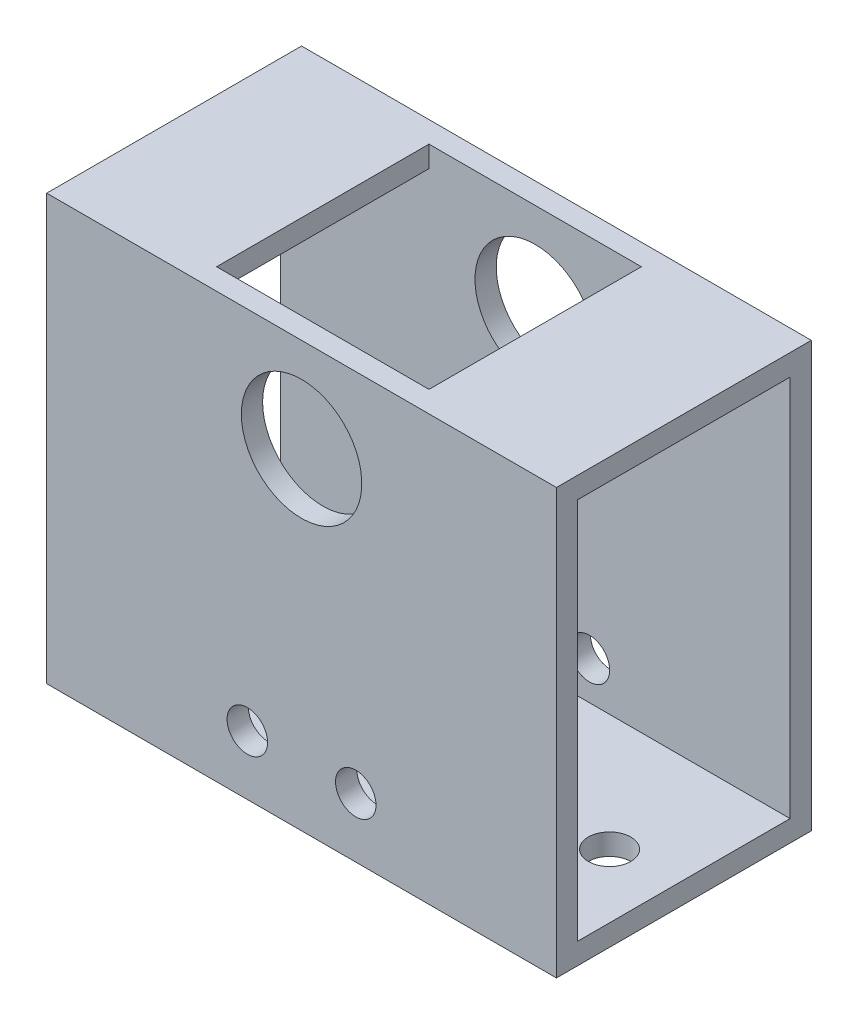
ISO-10303-21;
HEADER;
FILE_DESCRIPTION(('STEP AP214'),'2;1');
FILE_NAME('part.step','',(''),(''),'','','');
FILE_SCHEMA(('AUTOMOTIVE_DESIGN { 1 0 10303 214 1 1 1 1 }'));
ENDSEC;
DATA;
#1=APPLICATION_CONTEXT('core data for automotive mechanical design processes');
#2=APPLICATION_PROTOCOL_DEFINITION('international standard','automotive_design',2000,#1);
#3=PRODUCT_CONTEXT('',#1,'mechanical');
#4=PRODUCT('Part','Part','',(#3));
#5=PRODUCT_RELATED_PRODUCT_CATEGORY('part','',(#4));
#6=PRODUCT_DEFINITION_FORMATION('','',#4);
#7=PRODUCT_DEFINITION_CONTEXT('part definition',#1,'design');
#8=PRODUCT_DEFINITION('design','',#6,#7);
#9=PRODUCT_DEFINITION_SHAPE('','',#8);
#10=(LENGTH_UNIT() NAMED_UNIT(*) SI_UNIT(.MILLI.,.METRE.));
#11=(NAMED_UNIT(*) PLANE_ANGLE_UNIT() SI_UNIT($,.RADIAN.));
#12=(NAMED_UNIT(*) SI_UNIT($,.STERADIAN.) SOLID_ANGLE_UNIT());
#13=UNCERTAINTY_MEASURE_WITH_UNIT(LENGTH_MEASURE(1.E-05),#10,'distance_accuracy_value','');
#14=(GEOMETRIC_REPRESENTATION_CONTEXT(3) GLOBAL_UNCERTAINTY_ASSIGNED_CONTEXT((#13)) GLOBAL_UNIT_ASSIGNED_CONTEXT((#10,
#11,#12)) REPRESENTATION_CONTEXT('',''));
#15=CARTESIAN_POINT('',(0.,0.,0.));
#16=DIRECTION('',(0.,0.,1.));
#17=DIRECTION('',(1.,0.,0.));
#18=AXIS2_PLACEMENT_3D('',#15,#16,#17);
#19=CARTESIAN_POINT('',(76.2,31.75,19.05));
#20=DIRECTION('',(0.,-1.,0.));
#21=DIRECTION('',(0.,0.,-1.));
#22=AXIS2_PLACEMENT_3D('',#19,#20,#21);
#23=PLANE('',#22);
#24=DIRECTION('',(0.,0.,1.));
#25=VECTOR('',#24,1.);
#26=CARTESIAN_POINT('',(0.,31.75,19.05));
#27=LINE('',#26,#25);
#28=CARTESIAN_POINT('',(0.,31.75,-19.05));
#29=VERTEX_POINT('',#28);
#30=CARTESIAN_POINT('',(0.,31.75,19.05));
#31=VERTEX_POINT('',#30);
#32=EDGE_CURVE('E270',#29,#31,#27,.T.);
#33=ORIENTED_EDGE('',*,*,#32,.T.);
#34=DIRECTION('',(-1.,0.,0.));
#35=VECTOR('',#34,1.);
#36=CARTESIAN_POINT('',(76.2,31.75,19.05));
#37=LINE('',#36,#35);
#38=CARTESIAN_POINT('',(76.2,31.75,19.05));
#39=VERTEX_POINT('',#38);
#40=EDGE_CURVE('E49',#39,#31,#37,.T.);
#41=ORIENTED_EDGE('',*,*,#40,.F.);
#42=DIRECTION('',(0.,0.,1.));
#43=VECTOR('',#42,1.);
#44=CARTESIAN_POINT('',(76.2,31.75,19.05));
#45=LINE('',#44,#43);
#46=CARTESIAN_POINT('',(76.2,31.75,-19.05));
#47=VERTEX_POINT('',#46);
#48=EDGE_CURVE('E256',#47,#39,#45,.T.);
#49=ORIENTED_EDGE('',*,*,#48,.F.);
#50=DIRECTION('',(-1.,0.,0.));
#51=VECTOR('',#50,1.);
#52=CARTESIAN_POINT('',(76.2,31.75,-19.05));
#53=LINE('',#52,#51);
#54=EDGE_CURVE('E11',#47,#29,#53,.T.);
#55=ORIENTED_EDGE('',*,*,#54,.T.);
#56=EDGE_LOOP('',(#33,#41,#49,#55));
#57=FACE_BOUND('',#56,.T.);
#58=DIRECTION('',(0.,0.,-1.));
#59=VECTOR('',#58,1.);
#60=CARTESIAN_POINT('',(53.975,31.75,19.05));
#61=LINE('',#60,#59);
#62=CARTESIAN_POINT('',(53.975,31.75,15.875));
#63=VERTEX_POINT('',#62);
#64=CARTESIAN_POINT('',(53.975,31.75,-15.875));
#65=VERTEX_POINT('',#64);
#66=EDGE_CURVE('E159',#63,#65,#61,.T.);
#67=ORIENTED_EDGE('',*,*,#66,.F.);
#68=DIRECTION('',(1.,0.,0.));
#69=VECTOR('',#68,1.);
#70=CARTESIAN_POINT('',(76.2,31.75,15.875));
#71=LINE('',#70,#69);
#72=CARTESIAN_POINT('',(22.225,31.75,15.875));
#73=VERTEX_POINT('',#72);
#74=EDGE_CURVE('E143',#73,#63,#71,.T.);
#75=ORIENTED_EDGE('',*,*,#74,.F.);
#76=DIRECTION('',(0.,0.,1.));
#77=VECTOR('',#76,1.);
#78=CARTESIAN_POINT('',(22.225,31.75,19.05));
#79=LINE('',#78,#77);
#80=CARTESIAN_POINT('',(22.225,31.75,-15.875));
#81=VERTEX_POINT('',#80);
#82=EDGE_CURVE('E147',#81,#73,#79,.T.);
#83=ORIENTED_EDGE('',*,*,#82,.F.);
#84=DIRECTION('',(-1.,0.,0.));
#85=VECTOR('',#84,1.);
#86=CARTESIAN_POINT('',(76.2,31.75,-15.875));
#87=LINE('',#86,#85);
#88=EDGE_CURVE('E131',#65,#81,#87,.T.);
#89=ORIENTED_EDGE('',*,*,#88,.F.);
#90=EDGE_LOOP('',(#67,#75,#83,#89));
#91=FACE_BOUND('',#90,.T.);
#92=ADVANCED_FACE('F39',(#57,#91),#23,.F.);
#93=CARTESIAN_POINT('',(76.2,28.575,15.875));
#94=DIRECTION('',(0.,-1.,0.));
#95=DIRECTION('',(0.,0.,-1.));
#96=AXIS2_PLACEMENT_3D('',#93,#94,#95);
#97=PLANE('',#96);
#98=DIRECTION('',(-1.,0.,0.));
#99=VECTOR('',#98,1.);
#100=CARTESIAN_POINT('',(76.2,28.575,15.875));
#101=LINE('',#100,#99);
#102=CARTESIAN_POINT('',(76.2,28.575,15.875));
#103=VERTEX_POINT('',#102);
#104=CARTESIAN_POINT('',(53.975,28.575,15.875));
#105=VERTEX_POINT('',#104);
#106=EDGE_CURVE('E239',#103,#105,#101,.T.);
#107=ORIENTED_EDGE('',*,*,#106,.T.);
#108=DIRECTION('',(0.,0.,-1.));
#109=VECTOR('',#108,1.);
#110=CARTESIAN_POINT('',(53.975,28.575,15.875));
#111=LINE('',#110,#109);
#112=CARTESIAN_POINT('',(53.975,28.575,-15.875));
#113=VERTEX_POINT('',#112);
#114=EDGE_CURVE('E154',#105,#113,#111,.T.);
#115=ORIENTED_EDGE('',*,*,#114,.T.);
#116=DIRECTION('',(-1.,0.,0.));
#117=VECTOR('',#116,1.);
#118=CARTESIAN_POINT('',(76.2,28.575,-15.875));
#119=LINE('',#118,#117);
#120=CARTESIAN_POINT('',(76.2,28.575,-15.875));
#121=VERTEX_POINT('',#120);
#122=EDGE_CURVE('E244',#121,#113,#119,.T.);
#123=ORIENTED_EDGE('',*,*,#122,.F.);
#124=DIRECTION('',(0.,0.,1.));
#125=VECTOR('',#124,1.);
#126=CARTESIAN_POINT('',(76.2,28.575,15.875));
#127=LINE('',#126,#125);
#128=EDGE_CURVE('E213',#121,#103,#127,.T.);
#129=ORIENTED_EDGE('',*,*,#128,.T.);
#130=EDGE_LOOP('',(#107,#115,#123,#129));
#131=FACE_BOUND('',#130,.T.);
#132=ADVANCED_FACE('F326',(#131),#97,.T.);
#133=CARTESIAN_POINT('',(22.225,28.575,-15.875));
#134=VERTEX_POINT('',#133);
#135=CARTESIAN_POINT('',(0.,28.575,-15.875));
#136=VERTEX_POINT('',#135);
#137=EDGE_CURVE('E243',#134,#136,#119,.T.);
#138=ORIENTED_EDGE('',*,*,#137,.F.);
#139=DIRECTION('',(0.,0.,1.));
#140=VECTOR('',#139,1.);
#141=CARTESIAN_POINT('',(22.225,28.575,15.875));
#142=LINE('',#141,#140);
#143=CARTESIAN_POINT('',(22.225,28.575,15.875));
#144=VERTEX_POINT('',#143);
#145=EDGE_CURVE('E150',#134,#144,#142,.T.);
#146=ORIENTED_EDGE('',*,*,#145,.T.);
#147=CARTESIAN_POINT('',(0.,28.575,15.875));
#148=VERTEX_POINT('',#147);
#149=EDGE_CURVE('E238',#144,#148,#101,.T.);
#150=ORIENTED_EDGE('',*,*,#149,.T.);
#151=DIRECTION('',(0.,0.,1.));
#152=VECTOR('',#151,1.);
#153=CARTESIAN_POINT('',(0.,28.575,15.875));
#154=LINE('',#153,#152);
#155=EDGE_CURVE('E228',#136,#148,#154,.T.);
#156=ORIENTED_EDGE('',*,*,#155,.F.);
#157=EDGE_LOOP('',(#138,#146,#150,#156));
#158=FACE_BOUND('',#157,.T.);
#159=ADVANCED_FACE('F344',(#158),#97,.T.);
#160=CARTESIAN_POINT('',(76.2,0.,0.));
#161=DIRECTION('',(-1.,0.,0.));
#162=DIRECTION('',(0.,0.,1.));
#163=AXIS2_PLACEMENT_3D('',#160,#161,#162);
#164=PLANE('',#163);
#165=DIRECTION('',(0.,1.,0.));
#166=VECTOR('',#165,1.);
#167=CARTESIAN_POINT('',(76.2,-31.75,-19.05));
#168=LINE('',#167,#166);
#169=CARTESIAN_POINT('',(76.2,-31.75,-19.05));
#170=VERTEX_POINT('',#169);
#171=EDGE_CURVE('E252',#170,#47,#168,.T.);
#172=ORIENTED_EDGE('',*,*,#171,.T.);
#173=ORIENTED_EDGE('',*,*,#48,.T.);
#174=DIRECTION('',(0.,-1.,0.));
#175=VECTOR('',#174,1.);
#176=CARTESIAN_POINT('',(76.2,-31.75,19.05));
#177=LINE('',#176,#175);
#178=CARTESIAN_POINT('',(76.2,-31.75,19.05));
#179=VERTEX_POINT('',#178);
#180=EDGE_CURVE('E260',#39,#179,#177,.T.);
#181=ORIENTED_EDGE('',*,*,#180,.T.);
#182=DIRECTION('',(0.,0.,-1.));
#183=VECTOR('',#182,1.);
#184=CARTESIAN_POINT('',(76.2,-31.75,19.05));
#185=LINE('',#184,#183);
#186=EDGE_CURVE('E263',#179,#170,#185,.T.);
#187=ORIENTED_EDGE('',*,*,#186,.T.);
#188=EDGE_LOOP('',(#172,#173,#181,#187));
#189=FACE_BOUND('',#188,.T.);
#190=DIRECTION('',(0.,0.,-1.));
#191=VECTOR('',#190,1.);
#192=CARTESIAN_POINT('',(76.2,-28.575,15.875));
#193=LINE('',#192,#191);
#194=CARTESIAN_POINT('',(76.2,-28.575,15.875));
#195=VERTEX_POINT('',#194);
#196=CARTESIAN_POINT('',(76.2,-28.575,-15.875));
#197=VERTEX_POINT('',#196);
#198=EDGE_CURVE('E206',#195,#197,#193,.T.);
#199=ORIENTED_EDGE('',*,*,#198,.F.);
#200=DIRECTION('',(0.,-1.,0.));
#201=VECTOR('',#200,1.);
#202=CARTESIAN_POINT('',(76.2,-28.575,15.875));
#203=LINE('',#202,#201);
#204=EDGE_CURVE('E217',#103,#195,#203,.T.);
#205=ORIENTED_EDGE('',*,*,#204,.F.);
#206=ORIENTED_EDGE('',*,*,#128,.F.);
#207=DIRECTION('',(0.,1.,0.));
#208=VECTOR('',#207,1.);
#209=CARTESIAN_POINT('',(76.2,-28.575,-15.875));
#210=LINE('',#209,#208);
#211=EDGE_CURVE('E209',#197,#121,#210,.T.);
#212=ORIENTED_EDGE('',*,*,#211,.F.);
#213=EDGE_LOOP('',(#199,#205,#206,#212));
#214=FACE_BOUND('',#213,.T.);
#215=ADVANCED_FACE('F337',(#189,#214),#164,.F.);
#216=CARTESIAN_POINT('',(0.,0.,0.));
#217=DIRECTION('',(-1.,0.,0.));
#218=DIRECTION('',(0.,0.,1.));
#219=AXIS2_PLACEMENT_3D('',#216,#217,#218);
#220=PLANE('',#219);
#221=DIRECTION('',(0.,1.,0.));
#222=VECTOR('',#221,1.);
#223=CARTESIAN_POINT('',(0.,-31.75,-19.05));
#224=LINE('',#223,#222);
#225=CARTESIAN_POINT('',(0.,-31.75,-19.05));
#226=VERTEX_POINT('',#225);
#227=EDGE_CURVE('E251',#226,#29,#224,.T.);
#228=ORIENTED_EDGE('',*,*,#227,.F.);
#229=DIRECTION('',(0.,0.,-1.));
#230=VECTOR('',#229,1.);
#231=CARTESIAN_POINT('',(0.,-31.75,19.05));
#232=LINE('',#231,#230);
#233=CARTESIAN_POINT('',(0.,-31.75,19.05));
#234=VERTEX_POINT('',#233);
#235=EDGE_CURVE('E257',#234,#226,#232,.T.);
#236=ORIENTED_EDGE('',*,*,#235,.F.);
#237=DIRECTION('',(0.,-1.,0.));
#238=VECTOR('',#237,1.);
#239=CARTESIAN_POINT('',(0.,-31.75,19.05));
#240=LINE('',#239,#238);
#241=EDGE_CURVE('E273',#31,#234,#240,.T.);
#242=ORIENTED_EDGE('',*,*,#241,.F.);
#243=ORIENTED_EDGE('',*,*,#32,.F.);
#244=EDGE_LOOP('',(#228,#236,#242,#243));
#245=FACE_BOUND('',#244,.T.);
#246=DIRECTION('',(0.,-1.,0.));
#247=VECTOR('',#246,1.);
#248=CARTESIAN_POINT('',(0.,-28.575,15.875));
#249=LINE('',#248,#247);
#250=CARTESIAN_POINT('',(0.,-28.575,15.875));
#251=VERTEX_POINT('',#250);
#252=EDGE_CURVE('E210',#148,#251,#249,.T.);
#253=ORIENTED_EDGE('',*,*,#252,.T.);
#254=DIRECTION('',(0.,0.,-1.));
#255=VECTOR('',#254,1.);
#256=CARTESIAN_POINT('',(0.,-28.575,15.875));
#257=LINE('',#256,#255);
#258=CARTESIAN_POINT('',(0.,-28.575,-15.875));
#259=VERTEX_POINT('',#258);
#260=EDGE_CURVE('E205',#251,#259,#257,.T.);
#261=ORIENTED_EDGE('',*,*,#260,.T.);
#262=DIRECTION('',(0.,1.,0.));
#263=VECTOR('',#262,1.);
#264=CARTESIAN_POINT('',(0.,-28.575,-15.875));
#265=LINE('',#264,#263);
#266=EDGE_CURVE('E224',#259,#136,#265,.T.);
#267=ORIENTED_EDGE('',*,*,#266,.T.);
#268=ORIENTED_EDGE('',*,*,#155,.T.);
#269=EDGE_LOOP('',(#253,#261,#267,#268));
#270=FACE_BOUND('',#269,.T.);
#271=ADVANCED_FACE('F339',(#245,#270),#220,.T.);
#272=CARTESIAN_POINT('',(76.2,-31.75,-19.05));
#273=DIRECTION('',(0.,0.,1.));
#274=DIRECTION('',(1.,0.,0.));
#275=AXIS2_PLACEMENT_3D('',#272,#273,#274);
#276=PLANE('',#275);
#277=CARTESIAN_POINT('',(38.1,17.7,-19.05));
#278=DIRECTION('',(0.,0.,1.));
#279=DIRECTION('',(1.,0.,0.));
#280=AXIS2_PLACEMENT_3D('',#277,#278,#279);
#281=CIRCLE('',#280,9.);
#282=CARTESIAN_POINT('',(47.1,17.7,-19.05));
#283=VERTEX_POINT('',#282);
#284=EDGE_CURVE('E201',#283,#283,#281,.T.);
#285=ORIENTED_EDGE('',*,*,#284,.T.);
#286=EDGE_LOOP('',(#285));
#287=FACE_BOUND('',#286,.T.);
#288=CARTESIAN_POINT('',(46.205,-22.86,-19.05));
#289=DIRECTION('',(0.,0.,1.));
#290=DIRECTION('',(1.,0.,0.));
#291=AXIS2_PLACEMENT_3D('',#288,#289,#290);
#292=CIRCLE('',#291,3.025);
#293=CARTESIAN_POINT('',(49.23,-22.86,-19.05));
#294=VERTEX_POINT('',#293);
#295=EDGE_CURVE('E188',#294,#294,#292,.T.);
#296=ORIENTED_EDGE('',*,*,#295,.T.);
#297=EDGE_LOOP('',(#296));
#298=FACE_BOUND('',#297,.T.);
#299=CARTESIAN_POINT('',(29.995,-22.86,-19.05));
#300=DIRECTION('',(0.,0.,1.));
#301=DIRECTION('',(1.,0.,0.));
#302=AXIS2_PLACEMENT_3D('',#299,#300,#301);
#303=CIRCLE('',#302,3.025);
#304=CARTESIAN_POINT('',(33.02,-22.86,-19.05));
#305=VERTEX_POINT('',#304);
#306=EDGE_CURVE('E175',#305,#305,#303,.T.);
#307=ORIENTED_EDGE('',*,*,#306,.T.);
#308=EDGE_LOOP('',(#307));
#309=FACE_BOUND('',#308,.T.);
#310=ORIENTED_EDGE('',*,*,#227,.T.);
#311=ORIENTED_EDGE('',*,*,#54,.F.);
#312=ORIENTED_EDGE('',*,*,#171,.F.);
#313=DIRECTION('',(-1.,0.,0.));
#314=VECTOR('',#313,1.);
#315=CARTESIAN_POINT('',(76.2,-31.75,-19.05));
#316=LINE('',#315,#314);
#317=EDGE_CURVE('E266',#170,#226,#316,.T.);
#318=ORIENTED_EDGE('',*,*,#317,.T.);
#319=EDGE_LOOP('',(#310,#311,#312,#318));
#320=FACE_BOUND('',#319,.T.);
#321=ADVANCED_FACE('F41',(#287,#298,#309,#320),#276,.F.);
#322=CARTESIAN_POINT('',(76.2,-31.75,19.05));
#323=DIRECTION('',(0.,0.,-1.));
#324=DIRECTION('',(-1.,0.,0.));
#325=AXIS2_PLACEMENT_3D('',#322,#323,#324);
#326=PLANE('',#325);
#327=CARTESIAN_POINT('',(38.1,17.7,19.05));
#328=DIRECTION('',(0.,0.,-1.));
#329=DIRECTION('',(-1.,0.,0.));
#330=AXIS2_PLACEMENT_3D('',#327,#328,#329);
#331=CIRCLE('',#330,9.);
#332=CARTESIAN_POINT('',(29.1,17.7,19.05));
#333=VERTEX_POINT('',#332);
#334=EDGE_CURVE('E197',#333,#333,#331,.T.);
#335=ORIENTED_EDGE('',*,*,#334,.T.);
#336=EDGE_LOOP('',(#335));
#337=FACE_BOUND('',#336,.T.);
#338=CARTESIAN_POINT('',(46.205,-22.86,19.05));
#339=DIRECTION('',(0.,0.,-1.));
#340=DIRECTION('',(-1.,0.,0.));
#341=AXIS2_PLACEMENT_3D('',#338,#339,#340);
#342=CIRCLE('',#341,3.025);
#343=CARTESIAN_POINT('',(43.18,-22.86,19.05));
#344=VERTEX_POINT('',#343);
#345=EDGE_CURVE('E184',#344,#344,#342,.T.);
#346=ORIENTED_EDGE('',*,*,#345,.T.);
#347=EDGE_LOOP('',(#346));
#348=FACE_BOUND('',#347,.T.);
#349=CARTESIAN_POINT('',(29.995,-22.86,19.05));
#350=DIRECTION('',(0.,0.,-1.));
#351=DIRECTION('',(-1.,0.,0.));
#352=AXIS2_PLACEMENT_3D('',#349,#350,#351);
#353=CIRCLE('',#352,3.025);
#354=CARTESIAN_POINT('',(26.97,-22.86,19.05));
#355=VERTEX_POINT('',#354);
#356=EDGE_CURVE('E171',#355,#355,#353,.T.);
#357=ORIENTED_EDGE('',*,*,#356,.T.);
#358=EDGE_LOOP('',(#357));
#359=FACE_BOUND('',#358,.T.);
#360=ORIENTED_EDGE('',*,*,#241,.T.);
#361=DIRECTION('',(-1.,0.,0.));
#362=VECTOR('',#361,1.);
#363=CARTESIAN_POINT('',(76.2,-31.75,19.05));
#364=LINE('',#363,#362);
#365=EDGE_CURVE('E281',#179,#234,#364,.T.);
#366=ORIENTED_EDGE('',*,*,#365,.F.);
#367=ORIENTED_EDGE('',*,*,#180,.F.);
#368=ORIENTED_EDGE('',*,*,#40,.T.);
#369=EDGE_LOOP('',(#360,#366,#367,#368));
#370=FACE_BOUND('',#369,.T.);
#371=ADVANCED_FACE('F360',(#337,#348,#359,#370),#326,.F.);
#372=CARTESIAN_POINT('',(76.2,-31.75,19.05));
#373=DIRECTION('',(0.,1.,0.));
#374=DIRECTION('',(0.,0.,1.));
#375=AXIS2_PLACEMENT_3D('',#372,#373,#374);
#376=PLANE('',#375);
#377=CARTESIAN_POINT('',(9.525,-31.75,1.5875));
#378=DIRECTION('',(0.,1.,0.));
#379=DIRECTION('',(0.,0.,1.));
#380=AXIS2_PLACEMENT_3D('',#377,#378,#379);
#381=CIRCLE('',#380,3.175);
#382=CARTESIAN_POINT('',(9.525,-31.75,4.7625));
#383=VERTEX_POINT('',#382);
#384=EDGE_CURVE('E299',#383,#383,#381,.T.);
#385=ORIENTED_EDGE('',*,*,#384,.T.);
#386=EDGE_LOOP('',(#385));
#387=FACE_BOUND('',#386,.T.);
#388=CARTESIAN_POINT('',(66.675,-31.75,1.58749999999999));
#389=DIRECTION('',(0.,1.,0.));
#390=DIRECTION('',(0.,0.,1.));
#391=AXIS2_PLACEMENT_3D('',#388,#389,#390);
#392=CIRCLE('',#391,3.175);
#393=CARTESIAN_POINT('',(66.675,-31.75,4.76249999999999));
#394=VERTEX_POINT('',#393);
#395=EDGE_CURVE('E306',#394,#394,#392,.T.);
#396=ORIENTED_EDGE('',*,*,#395,.T.);
#397=EDGE_LOOP('',(#396));
#398=FACE_BOUND('',#397,.T.);
#399=ORIENTED_EDGE('',*,*,#235,.T.);
#400=ORIENTED_EDGE('',*,*,#317,.F.);
#401=ORIENTED_EDGE('',*,*,#186,.F.);
#402=ORIENTED_EDGE('',*,*,#365,.T.);
#403=EDGE_LOOP('',(#399,#400,#401,#402));
#404=FACE_BOUND('',#403,.T.);
#405=ADVANCED_FACE('F363',(#387,#398,#404),#376,.F.);
#406=CARTESIAN_POINT('',(76.2,-28.575,15.875));
#407=DIRECTION('',(0.,1.,0.));
#408=DIRECTION('',(0.,0.,1.));
#409=AXIS2_PLACEMENT_3D('',#406,#407,#408);
#410=PLANE('',#409);
#411=CARTESIAN_POINT('',(9.525,-28.575,1.5875));
#412=DIRECTION('',(0.,1.,0.));
#413=DIRECTION('',(0.,0.,1.));
#414=AXIS2_PLACEMENT_3D('',#411,#412,#413);
#415=CIRCLE('',#414,3.175);
#416=CARTESIAN_POINT('',(9.525,-28.575,4.7625));
#417=VERTEX_POINT('',#416);
#418=EDGE_CURVE('E43',#417,#417,#415,.T.);
#419=ORIENTED_EDGE('',*,*,#418,.F.);
#420=EDGE_LOOP('',(#419));
#421=FACE_BOUND('',#420,.T.);
#422=CARTESIAN_POINT('',(66.675,-28.575,1.58749999999999));
#423=DIRECTION('',(0.,1.,0.));
#424=DIRECTION('',(0.,0.,1.));
#425=AXIS2_PLACEMENT_3D('',#422,#423,#424);
#426=CIRCLE('',#425,3.175);
#427=CARTESIAN_POINT('',(66.675,-28.575,4.76249999999999));
#428=VERTEX_POINT('',#427);
#429=EDGE_CURVE('E296',#428,#428,#426,.T.);
#430=ORIENTED_EDGE('',*,*,#429,.F.);
#431=EDGE_LOOP('',(#430));
#432=FACE_BOUND('',#431,.T.);
#433=ORIENTED_EDGE('',*,*,#260,.F.);
#434=DIRECTION('',(-1.,0.,0.));
#435=VECTOR('',#434,1.);
#436=CARTESIAN_POINT('',(76.2,-28.575,15.875));
#437=LINE('',#436,#435);
#438=EDGE_CURVE('E220',#195,#251,#437,.T.);
#439=ORIENTED_EDGE('',*,*,#438,.F.);
#440=ORIENTED_EDGE('',*,*,#198,.T.);
#441=DIRECTION('',(-1.,0.,0.));
#442=VECTOR('',#441,1.);
#443=CARTESIAN_POINT('',(76.2,-28.575,-15.875));
#444=LINE('',#443,#442);
#445=EDGE_CURVE('E247',#197,#259,#444,.T.);
#446=ORIENTED_EDGE('',*,*,#445,.T.);
#447=EDGE_LOOP('',(#433,#439,#440,#446));
#448=FACE_BOUND('',#447,.T.);
#449=ADVANCED_FACE('F334',(#421,#432,#448),#410,.T.);
#450=CARTESIAN_POINT('',(76.2,-28.575,-15.875));
#451=DIRECTION('',(0.,0.,1.));
#452=DIRECTION('',(1.,0.,0.));
#453=AXIS2_PLACEMENT_3D('',#450,#451,#452);
#454=PLANE('',#453);
#455=DIRECTION('',(0.,-1.,0.));
#456=VECTOR('',#455,1.);
#457=CARTESIAN_POINT('',(22.225,76.2,-15.875));
#458=LINE('',#457,#456);
#459=EDGE_CURVE('E135',#81,#134,#458,.T.);
#460=ORIENTED_EDGE('',*,*,#459,.T.);
#461=ORIENTED_EDGE('',*,*,#137,.T.);
#462=ORIENTED_EDGE('',*,*,#266,.F.);
#463=ORIENTED_EDGE('',*,*,#445,.F.);
#464=ORIENTED_EDGE('',*,*,#211,.T.);
#465=ORIENTED_EDGE('',*,*,#122,.T.);
#466=DIRECTION('',(0.,-1.,0.));
#467=VECTOR('',#466,1.);
#468=CARTESIAN_POINT('',(53.975,76.2,-15.875));
#469=LINE('',#468,#467);
#470=EDGE_CURVE('E138',#65,#113,#469,.T.);
#471=ORIENTED_EDGE('',*,*,#470,.F.);
#472=ORIENTED_EDGE('',*,*,#88,.T.);
#473=EDGE_LOOP('',(#460,#461,#462,#463,#464,#465,#471,#472));
#474=FACE_BOUND('',#473,.T.);
#475=CARTESIAN_POINT('',(38.1,17.7,-15.875));
#476=DIRECTION('',(0.,0.,1.));
#477=DIRECTION('',(1.,0.,0.));
#478=AXIS2_PLACEMENT_3D('',#475,#476,#477);
#479=CIRCLE('',#478,9.);
#480=CARTESIAN_POINT('',(47.1,17.7,-15.875));
#481=VERTEX_POINT('',#480);
#482=EDGE_CURVE('E193',#481,#481,#479,.T.);
#483=ORIENTED_EDGE('',*,*,#482,.F.);
#484=EDGE_LOOP('',(#483));
#485=FACE_BOUND('',#484,.T.);
#486=CARTESIAN_POINT('',(29.995,-22.86,-15.875));
#487=DIRECTION('',(0.,0.,1.));
#488=DIRECTION('',(1.,0.,0.));
#489=AXIS2_PLACEMENT_3D('',#486,#487,#488);
#490=CIRCLE('',#489,3.025);
#491=CARTESIAN_POINT('',(33.02,-22.86,-15.875));
#492=VERTEX_POINT('',#491);
#493=EDGE_CURVE('E167',#492,#492,#490,.T.);
#494=ORIENTED_EDGE('',*,*,#493,.F.);
#495=EDGE_LOOP('',(#494));
#496=FACE_BOUND('',#495,.T.);
#497=CARTESIAN_POINT('',(46.205,-22.86,-15.875));
#498=DIRECTION('',(0.,0.,1.));
#499=DIRECTION('',(1.,0.,0.));
#500=AXIS2_PLACEMENT_3D('',#497,#498,#499);
#501=CIRCLE('',#500,3.025);
#502=CARTESIAN_POINT('',(49.23,-22.86,-15.875));
#503=VERTEX_POINT('',#502);
#504=EDGE_CURVE('E180',#503,#503,#501,.T.);
#505=ORIENTED_EDGE('',*,*,#504,.F.);
#506=EDGE_LOOP('',(#505));
#507=FACE_BOUND('',#506,.T.);
#508=ADVANCED_FACE('F133',(#474,#485,#496,#507),#454,.T.);
#509=CARTESIAN_POINT('',(76.2,-28.575,15.875));
#510=DIRECTION('',(0.,0.,-1.));
#511=DIRECTION('',(-1.,0.,0.));
#512=AXIS2_PLACEMENT_3D('',#509,#510,#511);
#513=PLANE('',#512);
#514=ORIENTED_EDGE('',*,*,#149,.F.);
#515=DIRECTION('',(0.,-1.,0.));
#516=VECTOR('',#515,1.);
#517=CARTESIAN_POINT('',(22.225,76.2,15.875));
#518=LINE('',#517,#516);
#519=EDGE_CURVE('E57',#73,#144,#518,.T.);
#520=ORIENTED_EDGE('',*,*,#519,.F.);
#521=ORIENTED_EDGE('',*,*,#74,.T.);
#522=DIRECTION('',(0.,-1.,0.));
#523=VECTOR('',#522,1.);
#524=CARTESIAN_POINT('',(53.975,76.2,15.875));
#525=LINE('',#524,#523);
#526=EDGE_CURVE('E63',#63,#105,#525,.T.);
#527=ORIENTED_EDGE('',*,*,#526,.T.);
#528=ORIENTED_EDGE('',*,*,#106,.F.);
#529=ORIENTED_EDGE('',*,*,#204,.T.);
#530=ORIENTED_EDGE('',*,*,#438,.T.);
#531=ORIENTED_EDGE('',*,*,#252,.F.);
#532=EDGE_LOOP('',(#514,#520,#521,#527,#528,#529,#530,#531));
#533=FACE_BOUND('',#532,.T.);
#534=CARTESIAN_POINT('',(38.1,17.7,15.875));
#535=DIRECTION('',(0.,0.,-1.));
#536=DIRECTION('',(-1.,0.,0.));
#537=AXIS2_PLACEMENT_3D('',#534,#535,#536);
#538=CIRCLE('',#537,9.);
#539=CARTESIAN_POINT('',(29.1,17.7,15.875));
#540=VERTEX_POINT('',#539);
#541=EDGE_CURVE('E192',#540,#540,#538,.T.);
#542=ORIENTED_EDGE('',*,*,#541,.F.);
#543=EDGE_LOOP('',(#542));
#544=FACE_BOUND('',#543,.T.);
#545=CARTESIAN_POINT('',(29.995,-22.86,15.875));
#546=DIRECTION('',(0.,0.,-1.));
#547=DIRECTION('',(-1.,0.,0.));
#548=AXIS2_PLACEMENT_3D('',#545,#546,#547);
#549=CIRCLE('',#548,3.025);
#550=CARTESIAN_POINT('',(26.97,-22.86,15.875));
#551=VERTEX_POINT('',#550);
#552=EDGE_CURVE('E166',#551,#551,#549,.T.);
#553=ORIENTED_EDGE('',*,*,#552,.F.);
#554=EDGE_LOOP('',(#553));
#555=FACE_BOUND('',#554,.T.);
#556=CARTESIAN_POINT('',(46.205,-22.86,15.875));
#557=DIRECTION('',(0.,0.,-1.));
#558=DIRECTION('',(-1.,0.,0.));
#559=AXIS2_PLACEMENT_3D('',#556,#557,#558);
#560=CIRCLE('',#559,3.025);
#561=CARTESIAN_POINT('',(43.18,-22.86,15.875));
#562=VERTEX_POINT('',#561);
#563=EDGE_CURVE('E179',#562,#562,#560,.T.);
#564=ORIENTED_EDGE('',*,*,#563,.F.);
#565=EDGE_LOOP('',(#564));
#566=FACE_BOUND('',#565,.T.);
#567=ADVANCED_FACE('F320',(#533,#544,#555,#566),#513,.T.);
#568=CARTESIAN_POINT('',(29.995,-22.86,-38.1));
#569=DIRECTION('',(0.,0.,1.));
#570=DIRECTION('',(1.,0.,0.));
#571=AXIS2_PLACEMENT_3D('',#568,#569,#570);
#572=CYLINDRICAL_SURFACE('',#571,3.025);
#573=ORIENTED_EDGE('',*,*,#552,.T.);
#574=EDGE_LOOP('',(#573));
#575=FACE_BOUND('',#574,.T.);
#576=ORIENTED_EDGE('',*,*,#356,.F.);
#577=EDGE_LOOP('',(#576));
#578=FACE_BOUND('',#577,.T.);
#579=ADVANCED_FACE('F376',(#575,#578),#572,.F.);
#580=CARTESIAN_POINT('',(46.205,-22.86,-38.1));
#581=DIRECTION('',(0.,0.,1.));
#582=DIRECTION('',(1.,0.,0.));
#583=AXIS2_PLACEMENT_3D('',#580,#581,#582);
#584=CYLINDRICAL_SURFACE('',#583,3.025);
#585=ORIENTED_EDGE('',*,*,#563,.T.);
#586=EDGE_LOOP('',(#585));
#587=FACE_BOUND('',#586,.T.);
#588=ORIENTED_EDGE('',*,*,#345,.F.);
#589=EDGE_LOOP('',(#588));
#590=FACE_BOUND('',#589,.T.);
#591=ADVANCED_FACE('F380',(#587,#590),#584,.F.);
#592=CARTESIAN_POINT('',(38.1,17.7,-38.1));
#593=DIRECTION('',(0.,0.,1.));
#594=DIRECTION('',(1.,0.,0.));
#595=AXIS2_PLACEMENT_3D('',#592,#593,#594);
#596=CYLINDRICAL_SURFACE('',#595,9.);
#597=ORIENTED_EDGE('',*,*,#541,.T.);
#598=EDGE_LOOP('',(#597));
#599=FACE_BOUND('',#598,.T.);
#600=ORIENTED_EDGE('',*,*,#334,.F.);
#601=EDGE_LOOP('',(#600));
#602=FACE_BOUND('',#601,.T.);
#603=ADVANCED_FACE('F387',(#599,#602),#596,.F.);
#604=ORIENTED_EDGE('',*,*,#493,.T.);
#605=EDGE_LOOP('',(#604));
#606=FACE_BOUND('',#605,.T.);
#607=ORIENTED_EDGE('',*,*,#306,.F.);
#608=EDGE_LOOP('',(#607));
#609=FACE_BOUND('',#608,.T.);
#610=ADVANCED_FACE('F383',(#606,#609),#572,.F.);
#611=ORIENTED_EDGE('',*,*,#504,.T.);
#612=EDGE_LOOP('',(#611));
#613=FACE_BOUND('',#612,.T.);
#614=ORIENTED_EDGE('',*,*,#295,.F.);
#615=EDGE_LOOP('',(#614));
#616=FACE_BOUND('',#615,.T.);
#617=ADVANCED_FACE('F386',(#613,#616),#584,.F.);
#618=ORIENTED_EDGE('',*,*,#482,.T.);
#619=EDGE_LOOP('',(#618));
#620=FACE_BOUND('',#619,.T.);
#621=ORIENTED_EDGE('',*,*,#284,.F.);
#622=EDGE_LOOP('',(#621));
#623=FACE_BOUND('',#622,.T.);
#624=ADVANCED_FACE('F391',(#620,#623),#596,.F.);
#625=CARTESIAN_POINT('',(53.975,76.2,15.875));
#626=DIRECTION('',(-1.,0.,0.));
#627=DIRECTION('',(0.,0.,1.));
#628=AXIS2_PLACEMENT_3D('',#625,#626,#627);
#629=PLANE('',#628);
#630=ORIENTED_EDGE('',*,*,#66,.T.);
#631=ORIENTED_EDGE('',*,*,#470,.T.);
#632=ORIENTED_EDGE('',*,*,#114,.F.);
#633=ORIENTED_EDGE('',*,*,#526,.F.);
#634=EDGE_LOOP('',(#630,#631,#632,#633));
#635=FACE_BOUND('',#634,.T.);
#636=ADVANCED_FACE('F323',(#635),#629,.T.);
#637=CARTESIAN_POINT('',(22.225,76.2,15.875));
#638=DIRECTION('',(1.,0.,0.));
#639=DIRECTION('',(0.,0.,-1.));
#640=AXIS2_PLACEMENT_3D('',#637,#638,#639);
#641=PLANE('',#640);
#642=ORIENTED_EDGE('',*,*,#82,.T.);
#643=ORIENTED_EDGE('',*,*,#519,.T.);
#644=ORIENTED_EDGE('',*,*,#145,.F.);
#645=ORIENTED_EDGE('',*,*,#459,.F.);
#646=EDGE_LOOP('',(#642,#643,#644,#645));
#647=FACE_BOUND('',#646,.T.);
#648=ADVANCED_FACE('F146',(#647),#641,.T.);
#649=CARTESIAN_POINT('',(66.675,-31.75,1.58749999999999));
#650=DIRECTION('',(0.,1.,0.));
#651=DIRECTION('',(0.,0.,1.));
#652=AXIS2_PLACEMENT_3D('',#649,#650,#651);
#653=CYLINDRICAL_SURFACE('',#652,3.175);
#654=ORIENTED_EDGE('',*,*,#429,.T.);
#655=EDGE_LOOP('',(#654));
#656=FACE_BOUND('',#655,.T.);
#657=ORIENTED_EDGE('',*,*,#395,.F.);
#658=EDGE_LOOP('',(#657));
#659=FACE_BOUND('',#658,.T.);
#660=ADVANCED_FACE('F400',(#656,#659),#653,.F.);
#661=CARTESIAN_POINT('',(9.525,-31.75,1.5875));
#662=DIRECTION('',(0.,1.,0.));
#663=DIRECTION('',(0.,0.,1.));
#664=AXIS2_PLACEMENT_3D('',#661,#662,#663);
#665=CYLINDRICAL_SURFACE('',#664,3.175);
#666=ORIENTED_EDGE('',*,*,#418,.T.);
#667=EDGE_LOOP('',(#666));
#668=FACE_BOUND('',#667,.T.);
#669=ORIENTED_EDGE('',*,*,#384,.F.);
#670=EDGE_LOOP('',(#669));
#671=FACE_BOUND('',#670,.T.);
#672=ADVANCED_FACE('F403',(#668,#671),#665,.F.);
#673=CLOSED_SHELL('',(#92,#132,#159,#215,#271,#321,#371,#405,#449,#508,#567,#579,#591,#603,#610,
#617,#624,#636,#648,#660,#672));
#674=MANIFOLD_SOLID_BREP('B2',#673);
#675=ADVANCED_BREP_SHAPE_REPRESENTATION('',(#18,#674),#14);
#676=SHAPE_DEFINITION_REPRESENTATION(#9,#675);
ENDSEC;
END-ISO-10303-21;
